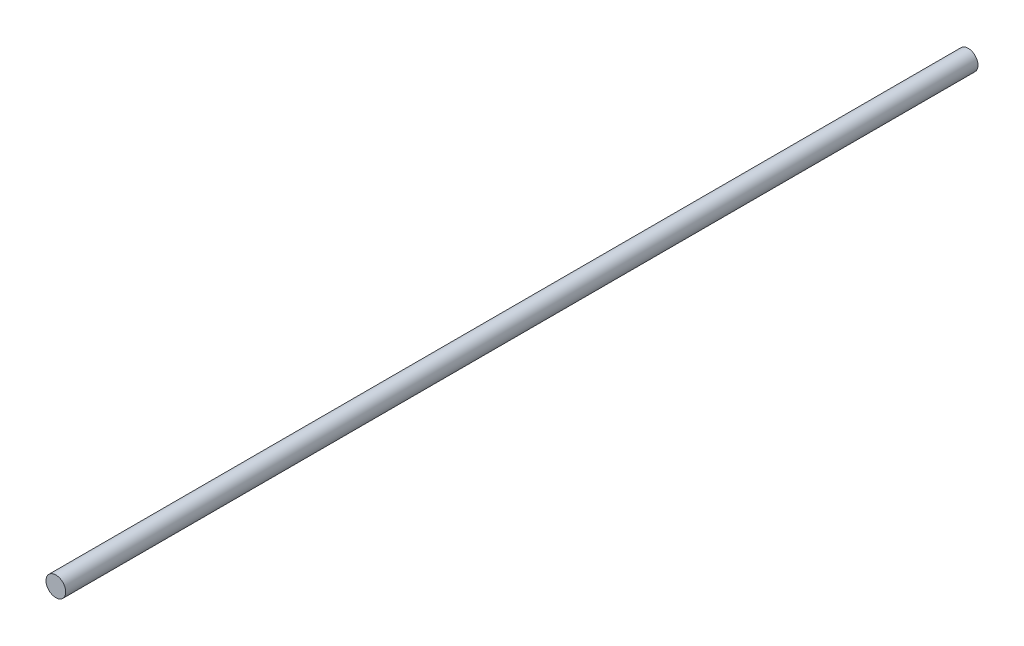
ISO-10303-21;
HEADER;
FILE_DESCRIPTION(('STEP AP214'),'2;1');
FILE_NAME('part.step','',(''),(''),'','','');
FILE_SCHEMA(('AUTOMOTIVE_DESIGN { 1 0 10303 214 1 1 1 1 }'));
ENDSEC;
DATA;
#1=APPLICATION_CONTEXT('core data for automotive mechanical design processes');
#2=APPLICATION_PROTOCOL_DEFINITION('international standard','automotive_design',2000,#1);
#3=PRODUCT_CONTEXT('',#1,'mechanical');
#4=PRODUCT('Part','Part','',(#3));
#5=PRODUCT_RELATED_PRODUCT_CATEGORY('part','',(#4));
#6=PRODUCT_DEFINITION_FORMATION('','',#4);
#7=PRODUCT_DEFINITION_CONTEXT('part definition',#1,'design');
#8=PRODUCT_DEFINITION('design','',#6,#7);
#9=PRODUCT_DEFINITION_SHAPE('','',#8);
#10=(LENGTH_UNIT() NAMED_UNIT(*) SI_UNIT(.MILLI.,.METRE.));
#11=(NAMED_UNIT(*) PLANE_ANGLE_UNIT() SI_UNIT($,.RADIAN.));
#12=(NAMED_UNIT(*) SI_UNIT($,.STERADIAN.) SOLID_ANGLE_UNIT());
#13=UNCERTAINTY_MEASURE_WITH_UNIT(LENGTH_MEASURE(1.E-05),#10,'distance_accuracy_value','');
#14=(GEOMETRIC_REPRESENTATION_CONTEXT(3) GLOBAL_UNCERTAINTY_ASSIGNED_CONTEXT((#13)) GLOBAL_UNIT_ASSIGNED_CONTEXT((#10,
#11,#12)) REPRESENTATION_CONTEXT('',''));
#15=CARTESIAN_POINT('',(0.,0.,0.));
#16=DIRECTION('',(0.,0.,1.));
#17=DIRECTION('',(1.,0.,0.));
#18=AXIS2_PLACEMENT_3D('',#15,#16,#17);
#19=CARTESIAN_POINT('',(0.,0.,370.));
#20=DIRECTION('',(0.,0.,-1.));
#21=DIRECTION('',(-1.,0.,0.));
#22=AXIS2_PLACEMENT_3D('',#19,#20,#21);
#23=CYLINDRICAL_SURFACE('',#22,4.);
#24=CARTESIAN_POINT('',(0.,0.,370.));
#25=DIRECTION('',(0.,0.,1.));
#26=DIRECTION('',(1.,0.,0.));
#27=AXIS2_PLACEMENT_3D('',#24,#25,#26);
#28=CIRCLE('',#27,4.);
#29=CARTESIAN_POINT('',(4.,0.,370.));
#30=VERTEX_POINT('',#29);
#31=EDGE_CURVE('E10',#30,#30,#28,.T.);
#32=ORIENTED_EDGE('',*,*,#31,.F.);
#33=EDGE_LOOP('',(#32));
#34=FACE_BOUND('',#33,.T.);
#35=CARTESIAN_POINT('',(0.,0.,0.));
#36=DIRECTION('',(0.,0.,1.));
#37=DIRECTION('',(1.,0.,0.));
#38=AXIS2_PLACEMENT_3D('',#35,#36,#37);
#39=CIRCLE('',#38,4.);
#40=CARTESIAN_POINT('',(4.,0.,0.));
#41=VERTEX_POINT('',#40);
#42=EDGE_CURVE('E33',#41,#41,#39,.T.);
#43=ORIENTED_EDGE('',*,*,#42,.T.);
#44=EDGE_LOOP('',(#43));
#45=FACE_BOUND('',#44,.T.);
#46=ADVANCED_FACE('F30',(#34,#45),#23,.T.);
#47=CARTESIAN_POINT('',(0.,0.,370.));
#48=DIRECTION('',(0.,0.,1.));
#49=DIRECTION('',(1.,0.,0.));
#50=AXIS2_PLACEMENT_3D('',#47,#48,#49);
#51=PLANE('',#50);
#52=ORIENTED_EDGE('',*,*,#31,.T.);
#53=EDGE_LOOP('',(#52));
#54=FACE_BOUND('',#53,.T.);
#55=ADVANCED_FACE('F45',(#54),#51,.T.);
#56=CARTESIAN_POINT('',(0.,0.,0.));
#57=DIRECTION('',(0.,0.,1.));
#58=DIRECTION('',(1.,0.,0.));
#59=AXIS2_PLACEMENT_3D('',#56,#57,#58);
#60=PLANE('',#59);
#61=ORIENTED_EDGE('',*,*,#42,.F.);
#62=EDGE_LOOP('',(#61));
#63=FACE_BOUND('',#62,.T.);
#64=ADVANCED_FACE('F43',(#63),#60,.F.);
#65=CLOSED_SHELL('',(#46,#55,#64));
#66=MANIFOLD_SOLID_BREP('B2',#65);
#67=ADVANCED_BREP_SHAPE_REPRESENTATION('',(#18,#66),#14);
#68=SHAPE_DEFINITION_REPRESENTATION(#9,#67);
ENDSEC;
END-ISO-10303-21;
